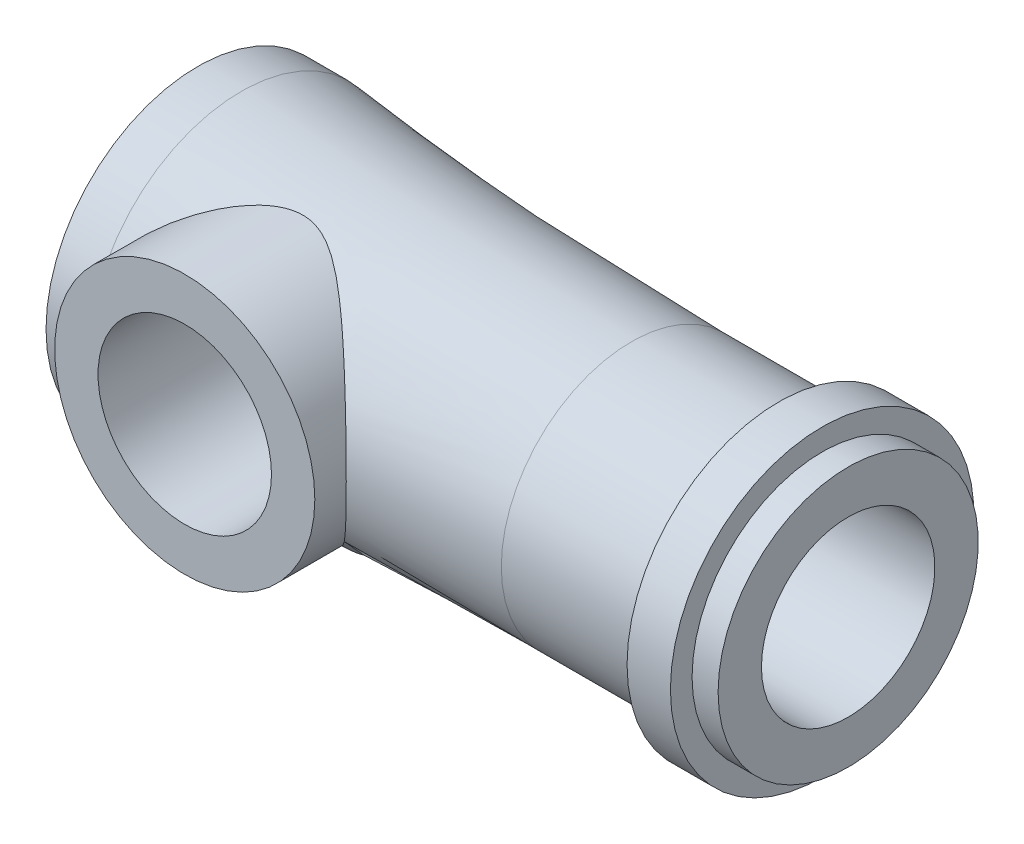
ISO-10303-21;
HEADER;
FILE_DESCRIPTION(('STEP AP214'),'2;1');
FILE_NAME('part.step','',(''),(''),'','','');
FILE_SCHEMA(('AUTOMOTIVE_DESIGN { 1 0 10303 214 1 1 1 1 }'));
ENDSEC;
DATA;
#1=APPLICATION_CONTEXT('core data for automotive mechanical design processes');
#2=APPLICATION_PROTOCOL_DEFINITION('international standard','automotive_design',2000,#1);
#3=PRODUCT_CONTEXT('',#1,'mechanical');
#4=PRODUCT('Part','Part','',(#3));
#5=PRODUCT_RELATED_PRODUCT_CATEGORY('part','',(#4));
#6=PRODUCT_DEFINITION_FORMATION('','',#4);
#7=PRODUCT_DEFINITION_CONTEXT('part definition',#1,'design');
#8=PRODUCT_DEFINITION('design','',#6,#7);
#9=PRODUCT_DEFINITION_SHAPE('','',#8);
#10=(LENGTH_UNIT() NAMED_UNIT(*) SI_UNIT(.MILLI.,.METRE.));
#11=(NAMED_UNIT(*) PLANE_ANGLE_UNIT() SI_UNIT($,.RADIAN.));
#12=(NAMED_UNIT(*) SI_UNIT($,.STERADIAN.) SOLID_ANGLE_UNIT());
#13=UNCERTAINTY_MEASURE_WITH_UNIT(LENGTH_MEASURE(1.E-05),#10,'distance_accuracy_value','');
#14=(GEOMETRIC_REPRESENTATION_CONTEXT(3) GLOBAL_UNCERTAINTY_ASSIGNED_CONTEXT((#13)) GLOBAL_UNIT_ASSIGNED_CONTEXT((#10,
#11,#12)) REPRESENTATION_CONTEXT('',''));
#15=CARTESIAN_POINT('',(0.,0.,0.));
#16=DIRECTION('',(0.,0.,1.));
#17=DIRECTION('',(1.,0.,0.));
#18=AXIS2_PLACEMENT_3D('',#15,#16,#17);
#19=CARTESIAN_POINT('',(50.,0.,0.));
#20=DIRECTION('',(-1.,0.,0.));
#21=DIRECTION('',(0.,0.,1.));
#22=AXIS2_PLACEMENT_3D('',#19,#20,#21);
#23=TOROIDAL_SURFACE('',#22,421.249999999999,406.249999999999);
#24=CARTESIAN_POINT('',(49.9999999999999,0.,0.));
#25=DIRECTION('',(-1.,0.,0.));
#26=DIRECTION('',(0.,0.,1.));
#27=AXIS2_PLACEMENT_3D('',#24,#25,#26);
#28=CIRCLE('',#27,15.);
#29=CARTESIAN_POINT('',(49.9999999999999,0.,15.));
#30=VERTEX_POINT('',#29);
#31=EDGE_CURVE('E58',#30,#30,#28,.T.);
#32=ORIENTED_EDGE('',*,*,#31,.T.);
#33=EDGE_LOOP('',(#32));
#34=FACE_BOUND('',#33,.T.);
#35=CARTESIAN_POINT('',(4.99980000000049,-8.29126045665027,15.4112225416414));
#36=CARTESIAN_POINT('',(5.1575587741467,-8.52908774068329,15.2633023816392));
#37=CARTESIAN_POINT('',(5.32071679464207,-8.76035165707777,15.1107369291407));
#38=CARTESIAN_POINT('',(5.65685873060117,-9.20971017689331,14.7975168529107));
#39=CARTESIAN_POINT('',(5.82983845808436,-9.42781031272215,14.636865680204));
#40=CARTESIAN_POINT('',(6.18445238918023,-9.85060183784807,14.3088572808972));
#41=CARTESIAN_POINT('',(6.36606969849085,-10.0553176816561,14.1415132393102));
#42=CARTESIAN_POINT('',(6.73752615173428,-10.4519367740162,13.8008689727515));
#43=CARTESIAN_POINT('',(6.92736623615937,-10.6438385505263,13.627568066925));
#44=CARTESIAN_POINT('',(7.50999918459366,-11.2022455252993,13.0986241178927));
#45=CARTESIAN_POINT('',(7.91437326878397,-11.5496419130478,12.7353630440585));
#46=CARTESIAN_POINT('',(8.75013282707914,-12.1950346156636,11.9962622762287));
#47=CARTESIAN_POINT('',(9.18152729751468,-12.4930143557056,11.6204184124394));
#48=CARTESIAN_POINT('',(10.0016139233894,-12.9988162495667,10.9220790238701));
#49=CARTESIAN_POINT('',(10.3866970012485,-13.2134565306456,10.6002497435757));
#50=CARTESIAN_POINT('',(11.1758493149513,-13.6088259722183,9.95858201588959));
#51=CARTESIAN_POINT('',(11.5799243130785,-13.7895447565501,9.63874420649479));
#52=CARTESIAN_POINT('',(12.201131965446,-14.0346441123542,9.16691698361828));
#53=CARTESIAN_POINT('',(12.4104097500373,-14.1119228596761,9.01117799779827));
#54=CARTESIAN_POINT('',(12.834694082388,-14.2578145511201,8.70351234347029));
#55=CARTESIAN_POINT('',(13.0496998242425,-14.3264287066055,8.55158514443621));
#56=CARTESIAN_POINT('',(13.4858678601043,-14.4547002781392,8.25336208086465));
#57=CARTESIAN_POINT('',(13.7070235791028,-14.5143668543973,8.10706057267079));
#58=CARTESIAN_POINT('',(14.1564524538812,-14.6244393269815,7.82218971255183));
#59=CARTESIAN_POINT('',(14.3847234113309,-14.67484805109,7.68361800861637));
#60=CARTESIAN_POINT('',(14.7963055152742,-14.7554514919375,7.44762944205453));
#61=CARTESIAN_POINT('',(14.9779709449857,-14.7876331329947,7.34804402289656));
#62=CARTESIAN_POINT('',(15.3464799551385,-14.8457811256767,7.15710773645564));
#63=CARTESIAN_POINT('',(15.5333236017964,-14.8717473977813,7.06575697453709));
#64=CARTESIAN_POINT('',(16.1015865921135,-14.939525170332,6.80770203002603));
#65=CARTESIAN_POINT('',(16.4918520437525,-14.971440544581,6.65632668465828));
#66=CARTESIAN_POINT('',(17.0518297142914,-14.9941563947516,6.48973345793702));
#67=CARTESIAN_POINT('',(17.213110624035,-14.9981392755499,6.44736546593199));
#68=CARTESIAN_POINT('',(17.5383220093268,-15.0008309452331,6.37440010277015));
#69=CARTESIAN_POINT('',(17.7022509650274,-14.9995426593787,6.34379621337856));
#70=CARTESIAN_POINT('',(18.031708216199,-14.9914777294262,6.29562384412375));
#71=CARTESIAN_POINT('',(18.1972344865129,-14.9847073127336,6.27804061685561));
#72=CARTESIAN_POINT('',(18.5288628544477,-14.9655946551901,6.25661055077066));
#73=CARTESIAN_POINT('',(18.6949649454471,-14.9532524781988,6.25276355452309));
#74=CARTESIAN_POINT('',(19.0264679496939,-14.9230559114648,6.25889371459745));
#75=CARTESIAN_POINT('',(19.1918685969451,-14.9051995923677,6.26887571384328));
#76=CARTESIAN_POINT('',(19.520640944619,-14.8642020292303,6.30202805684209));
#77=CARTESIAN_POINT('',(19.684012561647,-14.8410605687197,6.32519894084722));
#78=CARTESIAN_POINT('',(20.1701272939789,-14.7640756616409,6.4129081796553));
#79=CARTESIAN_POINT('',(20.4884890579009,-14.7027072201301,6.49563169639222));
#80=CARTESIAN_POINT('',(21.0627841411482,-14.5732713403704,6.68202963722383));
#81=CARTESIAN_POINT('',(21.3209629604112,-14.5075555271247,6.78076219914751));
#82=CARTESIAN_POINT('',(21.8261999898564,-14.3649874123387,6.99723730049265));
#83=CARTESIAN_POINT('',(22.0732487493376,-14.2881258719838,7.11499561990852));
#84=CARTESIAN_POINT('',(22.5578060059587,-14.1238924586859,7.3643791879095));
#85=CARTESIAN_POINT('',(22.7952737477239,-14.0364809454643,7.49605648999278));
#86=CARTESIAN_POINT('',(23.2609101288443,-13.8518821853065,7.76878641989948));
#87=CARTESIAN_POINT('',(23.4890753026191,-13.754691341102,7.90984249112757));
#88=CARTESIAN_POINT('',(23.9364805014948,-13.5510875954594,8.1978855739665));
#89=CARTESIAN_POINT('',(24.1557406084733,-13.4446973567781,8.34485755929795));
#90=CARTESIAN_POINT('',(24.5866638024654,-13.2226294873582,8.64276292585199));
#91=CARTESIAN_POINT('',(24.7983279078468,-13.1069531083599,8.79369577132404));
#92=CARTESIAN_POINT('',(25.2148188438445,-12.8662142889177,9.09792401528536));
#93=CARTESIAN_POINT('',(25.4196399522649,-12.741144263857,9.25122124171993));
#94=CARTESIAN_POINT('',(25.8226148416974,-12.4816462083764,9.55867035368772));
#95=CARTESIAN_POINT('',(26.0207679634995,-12.3472172567231,9.7128223219779));
#96=CARTESIAN_POINT('',(26.6051121827293,-11.9300489938139,10.1744463944239));
#97=CARTESIAN_POINT('',(26.981692673445,-11.6331363589991,10.4814620820695));
#98=CARTESIAN_POINT('',(27.7085816391956,-11.0007563188394,11.0862574168224));
#99=CARTESIAN_POINT('',(28.0589049418568,-10.6653109484488,11.3840422201025));
#100=CARTESIAN_POINT('',(28.6519947059388,-10.0385579281616,11.895433965338));
#101=CARTESIAN_POINT('',(28.9006447709442,-9.75549342077873,12.1123329680669));
#102=CARTESIAN_POINT('',(29.3798805501539,-9.16584746123313,12.5339480356218));
#103=CARTESIAN_POINT('',(29.6104659657582,-8.85926562050585,12.7386638990529));
#104=CARTESIAN_POINT('',(30.0511301121321,-8.22305504333634,13.1324795762956));
#105=CARTESIAN_POINT('',(30.261239455478,-7.89346201642921,13.321602634722));
#106=CARTESIAN_POINT('',(30.6587852512577,-7.2112498062661,13.6812717588922));
#107=CARTESIAN_POINT('',(30.8462270551292,-6.85863608821029,13.8518222083774));
#108=CARTESIAN_POINT('',(31.1598220502087,-6.20582344426946,14.1382749087324));
#109=CARTESIAN_POINT('',(31.2906706549712,-5.90964757512216,14.2582209960061));
#110=CARTESIAN_POINT('',(31.5346123776588,-5.30434476370491,14.4824002331083));
#111=CARTESIAN_POINT('',(31.6477094317844,-4.99522071185823,14.5866368661213));
#112=CARTESIAN_POINT('',(31.8545490207426,-4.36540230155464,14.7776427220214));
#113=CARTESIAN_POINT('',(31.9482978610069,-4.04471175268008,14.8644176353155));
#114=CARTESIAN_POINT('',(32.114976445698,-3.39343899688017,15.0189176276101));
#115=CARTESIAN_POINT('',(32.1879059757885,-3.06285668815714,15.0866425104889));
#116=CARTESIAN_POINT('',(32.3120228271749,-2.39188484530762,15.2020115096672));
#117=CARTESIAN_POINT('',(32.3630666878898,-2.05144576139957,15.2495231126387));
#118=CARTESIAN_POINT('',(32.4417028218718,-1.36552870003419,15.3227543417254));
#119=CARTESIAN_POINT('',(32.4692950434605,-1.02005071147477,15.3484739198194));
#120=CARTESIAN_POINT('',(32.50043957965,-0.327171107763516,15.3775065963387));
#121=CARTESIAN_POINT('',(32.5039989596232,0.0202299119781872,15.3808262800687));
#122=CARTESIAN_POINT('',(32.4870170065302,0.713909938996495,15.3649937846187));
#123=CARTESIAN_POINT('',(32.4664774206916,1.06018902579051,15.3458432345794));
#124=CARTESIAN_POINT('',(32.4050461678395,1.71349194349003,15.2886126265176));
#125=CARTESIAN_POINT('',(32.366439614415,2.02092285742697,15.2526584403701));
#126=CARTESIAN_POINT('',(32.270792692018,2.6303631170465,15.1636767130734));
#127=CARTESIAN_POINT('',(32.2137538452127,2.93237290824069,15.1106505817532));
#128=CARTESIAN_POINT('',(32.0821085948741,3.52924019536325,14.9884409479503));
#129=CARTESIAN_POINT('',(32.0074991188449,3.82409643042386,14.9192546196248));
#130=CARTESIAN_POINT('',(31.8417648936441,4.40511774468732,14.7658467010758));
#131=CARTESIAN_POINT('',(31.75063913884,4.69128229343697,14.6816241953439));
#132=CARTESIAN_POINT('',(31.5476418170528,5.26901680200603,14.4944260901412));
#133=CARTESIAN_POINT('',(31.4349115123364,5.56003433350275,14.390679709219));
#134=CARTESIAN_POINT('',(31.193744272518,6.13002039359486,14.1693760010077));
#135=CARTESIAN_POINT('',(31.065307199537,6.40898881639023,14.0518185524809));
#136=CARTESIAN_POINT('',(30.7940916467278,6.95412061292101,13.8044447194889));
#137=CARTESIAN_POINT('',(30.6513159992432,7.22028650027867,13.6746307563935));
#138=CARTESIAN_POINT('',(30.352638621245,7.73947098803723,13.4042058199157));
#139=CARTESIAN_POINT('',(30.1967340544823,7.99248672841298,13.2635925141243));
#140=CARTESIAN_POINT('',(29.7835695099388,8.62108872660872,12.8928068774563));
#141=CARTESIAN_POINT('',(29.5178513328324,8.98727169772342,12.6560297042308));
#142=CARTESIAN_POINT('',(28.9610634335426,9.6873249931339,12.164999411163));
#143=CARTESIAN_POINT('',(28.6699807360271,10.0211785926417,11.9107373610428));
#144=CARTESIAN_POINT('',(28.063620067938,10.6585361325458,11.3883343738797));
#145=CARTESIAN_POINT('',(27.748227319958,10.961878269877,11.1201298249993));
#146=CARTESIAN_POINT('',(27.0962860796002,11.5369058737054,10.5761063374454));
#147=CARTESIAN_POINT('',(26.7597450274218,11.8086023785434,10.3002900955878));
#148=CARTESIAN_POINT('',(26.0553602063401,12.3289658802099,9.73801699153038));
#149=CARTESIAN_POINT('',(25.6868806043723,12.5766987431066,9.45148895358041));
#150=CARTESIAN_POINT('',(25.1164494732251,12.9243672848712,9.02544930996221));
#151=CARTESIAN_POINT('',(24.9232084251126,13.0363402488191,8.88396108114594));
#152=CARTESIAN_POINT('',(24.530488015125,13.2522629702884,8.60356115171283));
#153=CARTESIAN_POINT('',(24.3310094069161,13.3562136918905,8.4646491430253));
#154=CARTESIAN_POINT('',(23.9265418016283,13.5554443369683,8.19177632153715));
#155=CARTESIAN_POINT('',(23.7215941414376,13.6507735642991,8.05779035231957));
#156=CARTESIAN_POINT('',(23.3043020026481,13.8333640779942,7.79581342661839));
#157=CARTESIAN_POINT('',(23.0919560476283,13.9206237411331,7.66782367884251));
#158=CARTESIAN_POINT('',(22.6595821754036,14.0865972220445,7.42074160693188));
#159=CARTESIAN_POINT('',(22.4395729122457,14.1653301039922,7.30162962807833));
#160=CARTESIAN_POINT('',(21.9906287741275,14.313983374488,7.07545462098897));
#161=CARTESIAN_POINT('',(21.7616992510119,14.3839089436846,6.96838451347479));
#162=CARTESIAN_POINT('',(21.3557329337382,14.4970777465137,6.79678413107426));
#163=CARTESIAN_POINT('',(21.1809070249662,14.5424982339754,6.72847661505532));
#164=CARTESIAN_POINT('',(20.8259210533489,14.6277667681779,6.60301457812797));
#165=CARTESIAN_POINT('',(20.6457611220218,14.6676149521734,6.5458597824964));
#166=CARTESIAN_POINT('',(20.2812072394436,14.7410750363747,6.44533394245392));
#167=CARTESIAN_POINT('',(20.0968349857573,14.7747131788098,6.40190431705019));
#168=CARTESIAN_POINT('',(19.724021581171,14.8354091104346,6.33085010451606));
#169=CARTESIAN_POINT('',(19.5355819654954,14.8624693367519,6.30321965862005));
#170=CARTESIAN_POINT('',(19.1534250520993,14.9098539444708,6.26533594983573));
#171=CARTESIAN_POINT('',(18.9596708136509,14.9300806333546,6.25532674665201));
#172=CARTESIAN_POINT('',(18.5714770662833,14.9629501666516,6.25432532772847));
#173=CARTESIAN_POINT('',(18.3770376000177,14.9755934750049,6.26333194847571));
#174=CARTESIAN_POINT('',(17.9891099850911,14.9932843996638,6.29995595888669));
#175=CARTESIAN_POINT('',(17.7956254163909,14.9983130018277,6.32761968801491));
#176=CARTESIAN_POINT('',(17.4118295382152,15.000969697283,6.39996747735914));
#177=CARTESIAN_POINT('',(17.2215190479968,14.9985959087868,6.44465586293783));
#178=CARTESIAN_POINT('',(16.8015407001257,14.9855248749175,6.5608178623189));
#179=CARTESIAN_POINT('',(16.5729911644255,14.973023475495,6.63610107697257));
#180=CARTESIAN_POINT('',(16.1233075662119,14.9383950885956,6.80435774142684));
#181=CARTESIAN_POINT('',(15.9021764088402,14.916264376465,6.89733802868337));
#182=CARTESIAN_POINT('',(15.4666625476735,14.863169296492,7.09712920449408));
#183=CARTESIAN_POINT('',(15.2523008073132,14.8321800040403,7.20397864572946));
#184=CARTESIAN_POINT('',(14.8303563563749,14.7620717933909,7.4280081147241));
#185=CARTESIAN_POINT('',(14.6227767069894,14.7229492612339,7.54519272148304));
#186=CARTESIAN_POINT('',(14.2035538709451,14.6349443351766,7.79333876428533));
#187=CARTESIAN_POINT('',(13.9922289627849,14.5856708791625,7.92469638608122));
#188=CARTESIAN_POINT('',(13.5757143934258,14.4791624088379,8.19362876599095));
#189=CARTESIAN_POINT('',(13.3705239649984,14.4219283952439,8.3312027411857));
#190=CARTESIAN_POINT('',(12.7627172738475,14.2385976651201,8.75088381111761));
#191=CARTESIAN_POINT('',(12.3682035514026,14.1009446653835,9.03974274330058));
#192=CARTESIAN_POINT('',(11.5966235380628,13.7957389856068,9.62634761072352));
#193=CARTESIAN_POINT('',(11.2195941317095,13.6281264221886,9.92411033159929));
#194=CARTESIAN_POINT('',(10.4821305319749,13.2634312334187,10.5217480264485));
#195=CARTESIAN_POINT('',(10.1216897138636,13.0663605082562,10.8216221011));
#196=CARTESIAN_POINT('',(9.37425520888758,12.6168386450113,11.4549325903107));
#197=CARTESIAN_POINT('',(8.98927860755985,12.3605779236435,11.7880699150276));
#198=CARTESIAN_POINT('',(8.42739035582051,11.9474579081833,12.2813823952211));
#199=CARTESIAN_POINT('',(8.24265606680313,11.8049326534326,12.4447853720169));
#200=CARTESIAN_POINT('',(7.87852551755641,11.510088582771,12.7689017874425));
#201=CARTESIAN_POINT('',(7.69913162534121,11.3577655142617,12.9296140195304));
#202=CARTESIAN_POINT('',(7.17119132460059,10.8874815519618,13.4051115044991));
#203=CARTESIAN_POINT('',(6.83103080580957,10.5548478058562,13.7148947621893));
#204=CARTESIAN_POINT('',(6.17666315701631,9.84952612354867,14.3154697465951));
#205=CARTESIAN_POINT('',(5.86244010584904,9.47686308671478,14.606273100426));
#206=CARTESIAN_POINT('',(5.46618802397812,8.9561804240581,14.9751292354921));
#207=CARTESIAN_POINT('',(5.37052525392032,8.82621861828946,15.0643575494682));
#208=CARTESIAN_POINT('',(5.18258245392529,8.56198017455372,15.2399734218666));
#209=CARTESIAN_POINT('',(5.09030271904478,8.42770316213666,15.326360732439));
#210=CARTESIAN_POINT('',(4.9998000000005,8.29126045665027,15.4112225416414));
#211=B_SPLINE_CURVE_WITH_KNOTS('',3,(#35,#36,#37,#38,#39,#40,#41,#42,#43,#44,#45,#46,#47,#48,
#49,#50,#51,#52,#53,#54,#55,#56,#57,#58,#59,#60,#61,#62,#63,#64,#65,#66,#67,#68,#69,#70,#71,#72,
#73,#74,#75,#76,#77,#78,#79,#80,#81,#82,#83,#84,#85,#86,#87,#88,#89,#90,#91,#92,#93,#94,#95,#96,
#97,#98,#99,#100,#101,#102,#103,#104,#105,#106,#107,#108,#109,#110,#111,#112,#113,#114,#115,
#116,#117,#118,#119,#120,#121,#122,#123,#124,#125,#126,#127,#128,#129,#130,#131,#132,#133,#134,
#135,#136,#137,#138,#139,#140,#141,#142,#143,#144,#145,#146,#147,#148,#149,#150,#151,#152,#153,
#154,#155,#156,#157,#158,#159,#160,#161,#162,#163,#164,#165,#166,#167,#168,#169,#170,#171,#172,
#173,#174,#175,#176,#177,#178,#179,#180,#181,#182,#183,#184,#185,#186,#187,#188,#189,#190,#191,
#192,#193,#194,#195,#196,#197,#198,#199,#200,#201,#202,#203,#204,#205,#206,#207,#208,#209,#210),
.UNSPECIFIED.,.F.,.F.,(4,2,2,2,2,2,2,2,2,2,2,2,2,2,2,2,2,2,2,2,2,2,2,2,2,2,2,2,2,2,2,2,2,2,2,2,
2,2,2,2,2,2,2,2,2,2,2,2,2,2,2,2,2,2,2,2,2,2,2,2,2,2,2,2,2,2,2,2,2,2,2,2,2,2,2,2,2,2,2,2,2,2,2,2,
2,2,2,4),(0.,0.964102694626007,1.92779733837325,2.88967894084893,3.8516708520037,
5.78391486448385,7.71680566537634,9.35301369919921,10.9897214158912,11.8057650292953,
12.6216944281723,13.436782719952,14.2516216299488,14.8802630778361,15.5089125681996,
16.7622757016909,17.2622691153178,17.7619850927088,18.2611342146732,18.7602776158785,
19.2595958616452,19.7589345623003,20.7587468197176,21.6099461409786,22.4618551071504,
23.3170709660995,24.1726025691905,25.0260835456069,25.8794496682436,26.7335123802273,
27.5876592799202,29.2938790777211,30.9991279855199,32.3022866122723,33.6054667750693,
34.9066677384243,36.2075609071698,37.2424853728679,38.2771800308841,39.3115369556749,
40.3459045288616,41.3869524041837,42.4280025735659,43.4687466731351,44.5094153211558,
45.4441262949113,46.3787600985068,47.3135574587738,48.2484117555118,49.2341082718569,
50.2198134415808,51.205324283427,52.1910485746959,53.7206870090361,55.2511125826746,
56.7892678576977,58.3268849904139,59.9105806574122,60.7035700801806,61.4964640557998,
62.2844913721303,63.0726768600878,63.8590620677564,64.6449825249305,65.2239327131153,
65.8028686383117,66.3792991241082,66.9555157149404,67.539652092778,68.1237527303532,
68.7093094928809,69.2950151239802,70.0166757387546,70.7386157430131,71.4626073439566,
72.1869213367263,72.9475595640274,73.708102258264,75.2303927400049,76.7557607232947,
78.2805141619408,79.9885702861666,80.8429297798566,81.6976626312907,83.3986863241646,
85.0986579925224,85.6517747038044,86.2049395418139),.UNSPECIFIED.);
#212=CARTESIAN_POINT('',(5.,-8.29156197588851,15.4110350074224));
#213=VERTEX_POINT('',#212);
#214=CARTESIAN_POINT('',(5.,8.29156197588851,15.4110350074224));
#215=VERTEX_POINT('',#214);
#216=EDGE_CURVE('E61',#213,#215,#211,.T.);
#217=ORIENTED_EDGE('',*,*,#216,.F.);
#218=CARTESIAN_POINT('',(5.,0.,0.));
#219=DIRECTION('',(-1.,0.,0.));
#220=DIRECTION('',(0.,0.,1.));
#221=AXIS2_PLACEMENT_3D('',#218,#219,#220);
#222=CIRCLE('',#221,17.5);
#223=EDGE_CURVE('E53',#215,#213,#222,.T.);
#224=ORIENTED_EDGE('',*,*,#223,.F.);
#225=EDGE_LOOP('',(#217,#224));
#226=FACE_BOUND('',#225,.T.);
#227=ADVANCED_FACE('F33',(#34,#226),#23,.F.);
#228=CARTESIAN_POINT('',(0.,0.,0.));
#229=DIRECTION('',(-1.,0.,0.));
#230=DIRECTION('',(0.,0.,1.));
#231=AXIS2_PLACEMENT_3D('',#228,#229,#230);
#232=CYLINDRICAL_SURFACE('',#231,17.5);
#233=CARTESIAN_POINT('',(0.,0.,0.));
#234=DIRECTION('',(-1.,0.,0.));
#235=DIRECTION('',(0.,0.,1.));
#236=AXIS2_PLACEMENT_3D('',#233,#234,#235);
#237=CIRCLE('',#236,17.5);
#238=CARTESIAN_POINT('',(0.,0.,17.5));
#239=VERTEX_POINT('',#238);
#240=EDGE_CURVE('E59',#239,#239,#237,.T.);
#241=ORIENTED_EDGE('',*,*,#240,.F.);
#242=EDGE_LOOP('',(#241));
#243=FACE_BOUND('',#242,.T.);
#244=CARTESIAN_POINT('',(5.,8.29156197588851,15.4110350074224));
#245=CARTESIAN_POINT('',(4.81449382348052,8.0119151305647,15.5615164202418));
#246=CARTESIAN_POINT('',(4.63698101810843,7.72391487344557,15.7066285542185));
#247=CARTESIAN_POINT('',(4.29940375620391,7.13165517312578,15.984254020399));
#248=CARTESIAN_POINT('',(4.13935593615138,6.82738063167029,16.1167553249157));
#249=CARTESIAN_POINT('',(3.83755584989061,6.2015375164462,16.3678148098346));
#250=CARTESIAN_POINT('',(3.6959283503949,5.87986998778535,16.4862774662849));
#251=CARTESIAN_POINT('',(3.43402569806888,5.22240629595298,16.7061834449688));
#252=CARTESIAN_POINT('',(3.31374462563236,4.88661408176949,16.8076314851181));
#253=CARTESIAN_POINT('',(3.09561326936407,4.20047502363731,16.99214389688));
#254=CARTESIAN_POINT('',(2.99790298467993,3.85005246320986,17.0750934241219));
#255=CARTESIAN_POINT('',(2.82753400466203,3.13885826265563,17.220024695847));
#256=CARTESIAN_POINT('',(2.75487723276872,2.77808583023736,17.2820048304341));
#257=CARTESIAN_POINT('',(2.63622690530275,2.05029769271698,17.383348393725));
#258=CARTESIAN_POINT('',(2.59014454128097,1.68330705133624,17.4227871490169));
#259=CARTESIAN_POINT('',(2.52522729659022,0.945190546812618,17.4783732957253));
#260=CARTESIAN_POINT('',(2.50638887407632,0.57406522752075,17.494523714738));
#261=CARTESIAN_POINT('',(2.49685989827317,-0.130968556588523,17.5026916392668));
#262=CARTESIAN_POINT('',(2.50349880459142,-0.464819140515712,17.4969987742649));
#263=CARTESIAN_POINT('',(2.53894623626323,-1.13045540395941,17.466626597404));
#264=CARTESIAN_POINT('',(2.56775335918558,-1.46224121276161,17.4419484866114));
#265=CARTESIAN_POINT('',(2.64708280482926,-2.12161361413096,17.3740820848193));
#266=CARTESIAN_POINT('',(2.69762684442955,-2.4491956688503,17.3308752823314));
#267=CARTESIAN_POINT('',(2.81960948585921,-3.09757333627406,17.2268062603317));
#268=CARTESIAN_POINT('',(2.89104810118893,-3.41836894459351,17.1659440294124));
#269=CARTESIAN_POINT('',(3.05199737601749,-4.04443495586051,17.0291814304867));
#270=CARTESIAN_POINT('',(3.14108766701685,-4.34989076341364,16.9536315115316));
#271=CARTESIAN_POINT('',(3.33709770763204,-4.95097427594417,16.7879438743813));
#272=CARTESIAN_POINT('',(3.44401916852168,-5.24660103434954,16.6978047560717));
#273=CARTESIAN_POINT('',(3.67439818982147,-5.82667081460608,16.5043435264785));
#274=CARTESIAN_POINT('',(3.79784751523667,-6.11111931530179,16.4010279815464));
#275=CARTESIAN_POINT('',(4.06007170787743,-6.66806106170404,16.1825959559237));
#276=CARTESIAN_POINT('',(4.1988426789509,-6.94055732224,16.0674824758699));
#277=CARTESIAN_POINT('',(4.44727499171208,-7.39405034854019,15.8625428552901));
#278=CARTESIAN_POINT('',(4.55336369206131,-7.57821571160887,15.7753421183109));
#279=CARTESIAN_POINT('',(4.77193706687461,-7.93983246340431,15.5964633924982));
#280=CARTESIAN_POINT('',(4.88440725903342,-8.11729764344404,15.5047956032083));
#281=CARTESIAN_POINT('',(5.,-8.2915619758885,15.4110350074224));
#282=B_SPLINE_CURVE_WITH_KNOTS('',3,(#244,#245,#246,#247,#248,#249,#250,#251,#252,#253,#254,
#255,#256,#257,#258,#259,#260,#261,#262,#263,#264,#265,#266,#267,#268,#269,#270,#271,#272,#273,
#274,#275,#276,#277,#278,#279,#280,#281),.UNSPECIFIED.,.F.,.F.,(4,2,2,2,2,2,2,2,2,2,2,2,2,2,2,2,
2,2,4),(0.,1.10329311635737,2.20762817883295,3.31909173476316,4.43024658598509,5.548118820306,
6.66607685825111,7.78027683557986,8.89433194846601,9.89496184413856,10.8955284420161,
11.8970970149407,12.8986662349968,13.8787587105266,14.8589453006201,15.8386453185329,
16.8180967791366,17.5070676298815,18.1945330180001),.UNSPECIFIED.);
#283=EDGE_CURVE('E11',#215,#213,#282,.T.);
#284=ORIENTED_EDGE('',*,*,#283,.F.);
#285=ORIENTED_EDGE('',*,*,#223,.T.);
#286=EDGE_LOOP('',(#284,#285));
#287=FACE_BOUND('',#286,.T.);
#288=ADVANCED_FACE('F55',(#243,#287),#232,.T.);
#289=CARTESIAN_POINT('',(60.,0.,0.));
#290=DIRECTION('',(-1.,0.,0.));
#291=DIRECTION('',(0.,0.,1.));
#292=AXIS2_PLACEMENT_3D('',#289,#290,#291);
#293=PLANE('',#292);
#294=CARTESIAN_POINT('',(60.,0.,0.));
#295=DIRECTION('',(-1.,0.,0.));
#296=DIRECTION('',(0.,0.,1.));
#297=AXIS2_PLACEMENT_3D('',#294,#295,#296);
#298=CIRCLE('',#297,10.);
#299=CARTESIAN_POINT('',(60.,0.,10.));
#300=VERTEX_POINT('',#299);
#301=EDGE_CURVE('E47',#300,#300,#298,.T.);
#302=ORIENTED_EDGE('',*,*,#301,.F.);
#303=EDGE_LOOP('',(#302));
#304=FACE_BOUND('',#303,.T.);
#305=ADVANCED_FACE('F35',(#304),#293,.F.);
#306=CARTESIAN_POINT('',(0.,0.,0.));
#307=DIRECTION('',(-1.,0.,0.));
#308=DIRECTION('',(0.,0.,1.));
#309=AXIS2_PLACEMENT_3D('',#306,#307,#308);
#310=CYLINDRICAL_SURFACE('',#309,10.);
#311=CARTESIAN_POINT('',(75.,0.,0.));
#312=DIRECTION('',(-1.,0.,0.));
#313=DIRECTION('',(0.,0.,1.));
#314=AXIS2_PLACEMENT_3D('',#311,#312,#313);
#315=CIRCLE('',#314,10.);
#316=CARTESIAN_POINT('',(75.,0.,10.));
#317=VERTEX_POINT('',#316);
#318=EDGE_CURVE('E119',#317,#317,#315,.T.);
#319=ORIENTED_EDGE('',*,*,#318,.F.);
#320=EDGE_LOOP('',(#319));
#321=FACE_BOUND('',#320,.T.);
#322=ORIENTED_EDGE('',*,*,#301,.T.);
#323=EDGE_LOOP('',(#322));
#324=FACE_BOUND('',#323,.T.);
#325=ADVANCED_FACE('F124',(#321,#324),#310,.F.);
#326=CARTESIAN_POINT('',(75.,10.,0.));
#327=DIRECTION('',(-1.,0.,0.));
#328=DIRECTION('',(0.,0.,1.));
#329=AXIS2_PLACEMENT_3D('',#326,#327,#328);
#330=PLANE('',#329);
#331=CARTESIAN_POINT('',(75.,0.,0.));
#332=DIRECTION('',(-1.,0.,0.));
#333=DIRECTION('',(0.,0.,1.));
#334=AXIS2_PLACEMENT_3D('',#331,#332,#333);
#335=CIRCLE('',#334,15.);
#336=CARTESIAN_POINT('',(75.,0.,15.));
#337=VERTEX_POINT('',#336);
#338=EDGE_CURVE('E116',#337,#337,#335,.T.);
#339=ORIENTED_EDGE('',*,*,#338,.F.);
#340=EDGE_LOOP('',(#339));
#341=FACE_BOUND('',#340,.T.);
#342=ORIENTED_EDGE('',*,*,#318,.T.);
#343=EDGE_LOOP('',(#342));
#344=FACE_BOUND('',#343,.T.);
#345=ADVANCED_FACE('F130',(#341,#344),#330,.F.);
#346=CARTESIAN_POINT('',(0.,0.,0.));
#347=DIRECTION('',(-1.,0.,0.));
#348=DIRECTION('',(0.,0.,1.));
#349=AXIS2_PLACEMENT_3D('',#346,#347,#348);
#350=CYLINDRICAL_SURFACE('',#349,15.);
#351=CARTESIAN_POINT('',(72.,0.,0.));
#352=DIRECTION('',(-1.,0.,0.));
#353=DIRECTION('',(0.,0.,1.));
#354=AXIS2_PLACEMENT_3D('',#351,#352,#353);
#355=CIRCLE('',#354,15.);
#356=CARTESIAN_POINT('',(72.,0.,15.));
#357=VERTEX_POINT('',#356);
#358=EDGE_CURVE('E113',#357,#357,#355,.T.);
#359=ORIENTED_EDGE('',*,*,#358,.F.);
#360=EDGE_LOOP('',(#359));
#361=FACE_BOUND('',#360,.T.);
#362=ORIENTED_EDGE('',*,*,#338,.T.);
#363=EDGE_LOOP('',(#362));
#364=FACE_BOUND('',#363,.T.);
#365=ADVANCED_FACE('F135',(#361,#364),#350,.T.);
#366=CARTESIAN_POINT('',(72.,15.,0.));
#367=DIRECTION('',(-1.,0.,0.));
#368=DIRECTION('',(0.,0.,1.));
#369=AXIS2_PLACEMENT_3D('',#366,#367,#368);
#370=PLANE('',#369);
#371=CARTESIAN_POINT('',(72.,0.,0.));
#372=DIRECTION('',(-1.,0.,0.));
#373=DIRECTION('',(0.,0.,1.));
#374=AXIS2_PLACEMENT_3D('',#371,#372,#373);
#375=CIRCLE('',#374,17.5);
#376=CARTESIAN_POINT('',(72.,0.,17.5));
#377=VERTEX_POINT('',#376);
#378=EDGE_CURVE('E110',#377,#377,#375,.T.);
#379=ORIENTED_EDGE('',*,*,#378,.F.);
#380=EDGE_LOOP('',(#379));
#381=FACE_BOUND('',#380,.T.);
#382=ORIENTED_EDGE('',*,*,#358,.T.);
#383=EDGE_LOOP('',(#382));
#384=FACE_BOUND('',#383,.T.);
#385=ADVANCED_FACE('F142',(#381,#384),#370,.F.);
#386=CARTESIAN_POINT('',(0.,0.,0.));
#387=DIRECTION('',(-1.,0.,0.));
#388=DIRECTION('',(0.,0.,1.));
#389=AXIS2_PLACEMENT_3D('',#386,#387,#388);
#390=CYLINDRICAL_SURFACE('',#389,17.5);
#391=CARTESIAN_POINT('',(67.,0.,0.));
#392=DIRECTION('',(-1.,0.,0.));
#393=DIRECTION('',(0.,0.,1.));
#394=AXIS2_PLACEMENT_3D('',#391,#392,#393);
#395=CIRCLE('',#394,17.5);
#396=CARTESIAN_POINT('',(67.,0.,17.5));
#397=VERTEX_POINT('',#396);
#398=EDGE_CURVE('E107',#397,#397,#395,.T.);
#399=ORIENTED_EDGE('',*,*,#398,.F.);
#400=EDGE_LOOP('',(#399));
#401=FACE_BOUND('',#400,.T.);
#402=ORIENTED_EDGE('',*,*,#378,.T.);
#403=EDGE_LOOP('',(#402));
#404=FACE_BOUND('',#403,.T.);
#405=ADVANCED_FACE('F146',(#401,#404),#390,.T.);
#406=CARTESIAN_POINT('',(67.,17.5,0.));
#407=DIRECTION('',(1.,0.,0.));
#408=DIRECTION('',(0.,0.,-1.));
#409=AXIS2_PLACEMENT_3D('',#406,#407,#408);
#410=PLANE('',#409);
#411=CARTESIAN_POINT('',(67.,0.,0.));
#412=DIRECTION('',(-1.,0.,0.));
#413=DIRECTION('',(0.,0.,1.));
#414=AXIS2_PLACEMENT_3D('',#411,#412,#413);
#415=CIRCLE('',#414,15.);
#416=CARTESIAN_POINT('',(67.,0.,15.));
#417=VERTEX_POINT('',#416);
#418=EDGE_CURVE('E104',#417,#417,#415,.T.);
#419=ORIENTED_EDGE('',*,*,#418,.F.);
#420=EDGE_LOOP('',(#419));
#421=FACE_BOUND('',#420,.T.);
#422=ORIENTED_EDGE('',*,*,#398,.T.);
#423=EDGE_LOOP('',(#422));
#424=FACE_BOUND('',#423,.T.);
#425=ADVANCED_FACE('F149',(#421,#424),#410,.F.);
#426=CARTESIAN_POINT('',(0.,0.,0.));
#427=DIRECTION('',(-1.,0.,0.));
#428=DIRECTION('',(0.,0.,1.));
#429=AXIS2_PLACEMENT_3D('',#426,#427,#428);
#430=CYLINDRICAL_SURFACE('',#429,15.);
#431=ORIENTED_EDGE('',*,*,#31,.F.);
#432=EDGE_LOOP('',(#431));
#433=FACE_BOUND('',#432,.T.);
#434=ORIENTED_EDGE('',*,*,#418,.T.);
#435=EDGE_LOOP('',(#434));
#436=FACE_BOUND('',#435,.T.);
#437=ADVANCED_FACE('F77',(#433,#436),#430,.T.);
#438=CARTESIAN_POINT('',(0.,0.,0.));
#439=DIRECTION('',(1.,0.,0.));
#440=DIRECTION('',(0.,0.,-1.));
#441=AXIS2_PLACEMENT_3D('',#438,#439,#440);
#442=PLANE('',#441);
#443=ORIENTED_EDGE('',*,*,#240,.T.);
#444=EDGE_LOOP('',(#443));
#445=FACE_BOUND('',#444,.T.);
#446=ADVANCED_FACE('F68',(#445),#442,.F.);
#447=CARTESIAN_POINT('',(17.5,0.,19.));
#448=DIRECTION('',(0.,0.,-1.));
#449=DIRECTION('',(-1.,0.,0.));
#450=AXIS2_PLACEMENT_3D('',#447,#448,#449);
#451=CYLINDRICAL_SURFACE('',#450,15.);
#452=CARTESIAN_POINT('',(17.5,0.,19.));
#453=DIRECTION('',(0.,0.,1.));
#454=DIRECTION('',(1.,0.,0.));
#455=AXIS2_PLACEMENT_3D('',#452,#453,#454);
#456=CIRCLE('',#455,15.);
#457=CARTESIAN_POINT('',(32.5,0.,19.));
#458=VERTEX_POINT('',#457);
#459=EDGE_CURVE('E63',#458,#458,#456,.T.);
#460=ORIENTED_EDGE('',*,*,#459,.F.);
#461=EDGE_LOOP('',(#460));
#462=FACE_BOUND('',#461,.T.);
#463=ORIENTED_EDGE('',*,*,#283,.T.);
#464=ORIENTED_EDGE('',*,*,#216,.T.);
#465=EDGE_LOOP('',(#463,#464));
#466=FACE_BOUND('',#465,.T.);
#467=ADVANCED_FACE('F65',(#462,#466),#451,.T.);
#468=CARTESIAN_POINT('',(17.5,0.,19.));
#469=DIRECTION('',(0.,0.,1.));
#470=DIRECTION('',(1.,0.,0.));
#471=AXIS2_PLACEMENT_3D('',#468,#469,#470);
#472=PLANE('',#471);
#473=CARTESIAN_POINT('',(17.5,0.,19.));
#474=DIRECTION('',(0.,0.,1.));
#475=DIRECTION('',(1.,0.,0.));
#476=AXIS2_PLACEMENT_3D('',#473,#474,#475);
#477=CIRCLE('',#476,10.);
#478=CARTESIAN_POINT('',(27.5,0.,19.));
#479=VERTEX_POINT('',#478);
#480=EDGE_CURVE('E221',#479,#479,#477,.T.);
#481=ORIENTED_EDGE('',*,*,#480,.F.);
#482=EDGE_LOOP('',(#481));
#483=FACE_BOUND('',#482,.T.);
#484=ORIENTED_EDGE('',*,*,#459,.T.);
#485=EDGE_LOOP('',(#484));
#486=FACE_BOUND('',#485,.T.);
#487=ADVANCED_FACE('F67',(#483,#486),#472,.T.);
#488=CARTESIAN_POINT('',(17.5,0.,-6.));
#489=DIRECTION('',(0.,0.,1.));
#490=DIRECTION('',(1.,0.,0.));
#491=AXIS2_PLACEMENT_3D('',#488,#489,#490);
#492=CYLINDRICAL_SURFACE('',#491,10.);
#493=CARTESIAN_POINT('',(17.5,0.,-6.));
#494=DIRECTION('',(0.,0.,1.));
#495=DIRECTION('',(1.,0.,0.));
#496=AXIS2_PLACEMENT_3D('',#493,#494,#495);
#497=CIRCLE('',#496,10.);
#498=CARTESIAN_POINT('',(27.5,0.,-6.));
#499=VERTEX_POINT('',#498);
#500=EDGE_CURVE('E220',#499,#499,#497,.T.);
#501=ORIENTED_EDGE('',*,*,#500,.F.);
#502=EDGE_LOOP('',(#501));
#503=FACE_BOUND('',#502,.T.);
#504=ORIENTED_EDGE('',*,*,#480,.T.);
#505=EDGE_LOOP('',(#504));
#506=FACE_BOUND('',#505,.T.);
#507=ADVANCED_FACE('F74',(#503,#506),#492,.F.);
#508=CARTESIAN_POINT('',(17.5,0.,-6.));
#509=DIRECTION('',(0.,0.,1.));
#510=DIRECTION('',(1.,0.,0.));
#511=AXIS2_PLACEMENT_3D('',#508,#509,#510);
#512=PLANE('',#511);
#513=ORIENTED_EDGE('',*,*,#500,.T.);
#514=EDGE_LOOP('',(#513));
#515=FACE_BOUND('',#514,.T.);
#516=ADVANCED_FACE('F204',(#515),#512,.T.);
#517=CLOSED_SHELL('',(#227,#288,#305,#325,#345,#365,#385,#405,#425,#437,#446,#467,#487,#507,#516));
#518=MANIFOLD_SOLID_BREP('B2',#517);
#519=ADVANCED_BREP_SHAPE_REPRESENTATION('',(#18,#518),#14);
#520=SHAPE_DEFINITION_REPRESENTATION(#9,#519);
ENDSEC;
END-ISO-10303-21;
